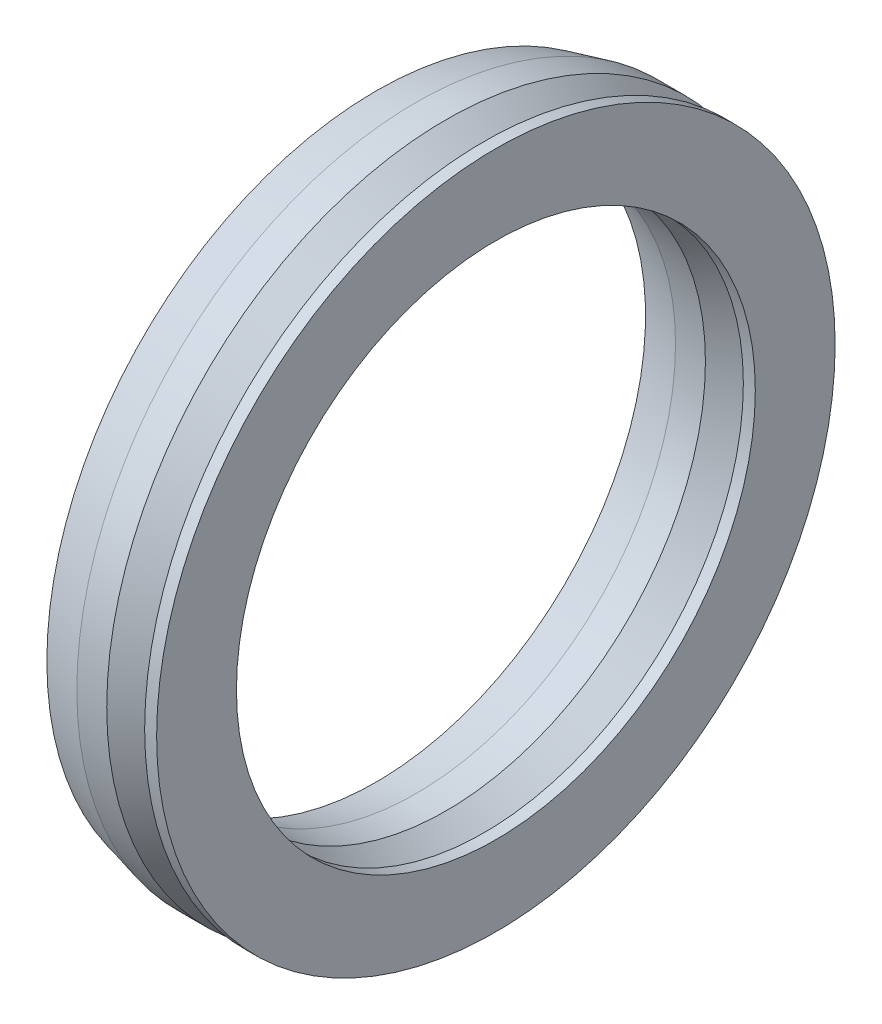
ISO-10303-21;
HEADER;
FILE_DESCRIPTION(('STEP AP214'),'2;1');
FILE_NAME('part.step','',(''),(''),'','','');
FILE_SCHEMA(('AUTOMOTIVE_DESIGN { 1 0 10303 214 1 1 1 1 }'));
ENDSEC;
DATA;
#1=APPLICATION_CONTEXT('core data for automotive mechanical design processes');
#2=APPLICATION_PROTOCOL_DEFINITION('international standard','automotive_design',2000,#1);
#3=PRODUCT_CONTEXT('',#1,'mechanical');
#4=PRODUCT('Part','Part','',(#3));
#5=PRODUCT_RELATED_PRODUCT_CATEGORY('part','',(#4));
#6=PRODUCT_DEFINITION_FORMATION('','',#4);
#7=PRODUCT_DEFINITION_CONTEXT('part definition',#1,'design');
#8=PRODUCT_DEFINITION('design','',#6,#7);
#9=PRODUCT_DEFINITION_SHAPE('','',#8);
#10=(LENGTH_UNIT() NAMED_UNIT(*) SI_UNIT(.MILLI.,.METRE.));
#11=(NAMED_UNIT(*) PLANE_ANGLE_UNIT() SI_UNIT($,.RADIAN.));
#12=(NAMED_UNIT(*) SI_UNIT($,.STERADIAN.) SOLID_ANGLE_UNIT());
#13=UNCERTAINTY_MEASURE_WITH_UNIT(LENGTH_MEASURE(1.E-05),#10,'distance_accuracy_value','');
#14=(GEOMETRIC_REPRESENTATION_CONTEXT(3) GLOBAL_UNCERTAINTY_ASSIGNED_CONTEXT((#13)) GLOBAL_UNIT_ASSIGNED_CONTEXT((#10,
#11,#12)) REPRESENTATION_CONTEXT('',''));
#15=CARTESIAN_POINT('',(0.,0.,0.));
#16=DIRECTION('',(0.,0.,1.));
#17=DIRECTION('',(1.,0.,0.));
#18=AXIS2_PLACEMENT_3D('',#15,#16,#17);
#19=CARTESIAN_POINT('',(-63.8265802983972,0.,0.));
#20=DIRECTION('',(-1.,0.,0.));
#21=DIRECTION('',(0.,0.,1.));
#22=AXIS2_PLACEMENT_3D('',#19,#20,#21);
#23=CYLINDRICAL_SURFACE('',#22,34.);
#24=CARTESIAN_POINT('',(-8.,0.,0.));
#25=DIRECTION('',(-1.,0.,0.));
#26=DIRECTION('',(0.,0.,1.));
#27=AXIS2_PLACEMENT_3D('',#24,#25,#26);
#28=CIRCLE('',#27,34.);
#29=CARTESIAN_POINT('',(-8.,0.,34.));
#30=VERTEX_POINT('',#29);
#31=EDGE_CURVE('E10',#30,#30,#28,.T.);
#32=ORIENTED_EDGE('',*,*,#31,.F.);
#33=EDGE_LOOP('',(#32));
#34=FACE_BOUND('',#33,.T.);
#35=CARTESIAN_POINT('',(-5.,0.,0.));
#36=DIRECTION('',(-1.,0.,0.));
#37=DIRECTION('',(0.,0.,1.));
#38=AXIS2_PLACEMENT_3D('',#35,#36,#37);
#39=CIRCLE('',#38,34.);
#40=CARTESIAN_POINT('',(-5.,0.,34.));
#41=VERTEX_POINT('',#40);
#42=EDGE_CURVE('E100',#41,#41,#39,.T.);
#43=ORIENTED_EDGE('',*,*,#42,.T.);
#44=EDGE_LOOP('',(#43));
#45=FACE_BOUND('',#44,.T.);
#46=ADVANCED_FACE('F33',(#34,#45),#23,.T.);
#47=CARTESIAN_POINT('',(-8.,0.,0.));
#48=DIRECTION('',(1.,0.,0.));
#49=DIRECTION('',(0.,0.,-1.));
#50=AXIS2_PLACEMENT_3D('',#47,#48,#49);
#51=CONICAL_SURFACE('',#50,34.,0.244978663126865);
#52=CARTESIAN_POINT('',(-12.,0.,0.));
#53=DIRECTION('',(-1.,0.,0.));
#54=DIRECTION('',(0.,0.,1.));
#55=AXIS2_PLACEMENT_3D('',#52,#53,#54);
#56=CIRCLE('',#55,33.);
#57=CARTESIAN_POINT('',(-12.,0.,33.));
#58=VERTEX_POINT('',#57);
#59=EDGE_CURVE('E39',#58,#58,#56,.T.);
#60=ORIENTED_EDGE('',*,*,#59,.F.);
#61=EDGE_LOOP('',(#60));
#62=FACE_BOUND('',#61,.T.);
#63=ORIENTED_EDGE('',*,*,#31,.T.);
#64=EDGE_LOOP('',(#63));
#65=FACE_BOUND('',#64,.T.);
#66=ADVANCED_FACE('F215',(#62,#65),#51,.T.);
#67=CARTESIAN_POINT('',(-12.,33.,0.));
#68=DIRECTION('',(1.,0.,0.));
#69=DIRECTION('',(0.,0.,-1.));
#70=AXIS2_PLACEMENT_3D('',#67,#68,#69);
#71=PLANE('',#70);
#72=CARTESIAN_POINT('',(-12.,0.,0.));
#73=DIRECTION('',(-1.,0.,0.));
#74=DIRECTION('',(0.,0.,1.));
#75=AXIS2_PLACEMENT_3D('',#72,#73,#74);
#76=CIRCLE('',#75,32.);
#77=CARTESIAN_POINT('',(-12.,0.,32.));
#78=VERTEX_POINT('',#77);
#79=EDGE_CURVE('E43',#78,#78,#76,.T.);
#80=ORIENTED_EDGE('',*,*,#79,.F.);
#81=EDGE_LOOP('',(#80));
#82=FACE_BOUND('',#81,.T.);
#83=ORIENTED_EDGE('',*,*,#59,.T.);
#84=EDGE_LOOP('',(#83));
#85=FACE_BOUND('',#84,.T.);
#86=ADVANCED_FACE('F210',(#82,#85),#71,.F.);
#87=CARTESIAN_POINT('',(-12.,0.,0.));
#88=DIRECTION('',(1.,0.,0.));
#89=DIRECTION('',(0.,0.,-1.));
#90=AXIS2_PLACEMENT_3D('',#87,#88,#89);
#91=CONICAL_SURFACE('',#90,32.,0.244978663126865);
#92=CARTESIAN_POINT('',(-8.,0.,0.));
#93=DIRECTION('',(-1.,0.,0.));
#94=DIRECTION('',(0.,0.,1.));
#95=AXIS2_PLACEMENT_3D('',#92,#93,#94);
#96=CIRCLE('',#95,33.);
#97=CARTESIAN_POINT('',(-8.,0.,33.));
#98=VERTEX_POINT('',#97);
#99=EDGE_CURVE('E47',#98,#98,#96,.T.);
#100=ORIENTED_EDGE('',*,*,#99,.F.);
#101=EDGE_LOOP('',(#100));
#102=FACE_BOUND('',#101,.T.);
#103=ORIENTED_EDGE('',*,*,#79,.T.);
#104=EDGE_LOOP('',(#103));
#105=FACE_BOUND('',#104,.T.);
#106=ADVANCED_FACE('F204',(#102,#105),#91,.F.);
#107=CARTESIAN_POINT('',(-8.,0.,0.));
#108=DIRECTION('',(-1.,0.,0.));
#109=DIRECTION('',(0.,0.,1.));
#110=AXIS2_PLACEMENT_3D('',#107,#108,#109);
#111=CONICAL_SURFACE('',#110,33.,0.540419500270585);
#112=CARTESIAN_POINT('',(-3.,0.,0.));
#113=DIRECTION('',(-1.,0.,0.));
#114=DIRECTION('',(0.,0.,1.));
#115=AXIS2_PLACEMENT_3D('',#112,#113,#114);
#116=CIRCLE('',#115,30.);
#117=CARTESIAN_POINT('',(-3.,0.,30.));
#118=VERTEX_POINT('',#117);
#119=EDGE_CURVE('E52',#118,#118,#116,.T.);
#120=ORIENTED_EDGE('',*,*,#119,.F.);
#121=EDGE_LOOP('',(#120));
#122=FACE_BOUND('',#121,.T.);
#123=ORIENTED_EDGE('',*,*,#99,.T.);
#124=EDGE_LOOP('',(#123));
#125=FACE_BOUND('',#124,.T.);
#126=ADVANCED_FACE('F198',(#122,#125),#111,.F.);
#127=CARTESIAN_POINT('',(-3.,0.,0.));
#128=DIRECTION('',(1.,0.,0.));
#129=DIRECTION('',(0.,0.,-1.));
#130=AXIS2_PLACEMENT_3D('',#127,#128,#129);
#131=CONICAL_SURFACE('',#130,30.,0.540419500270585);
#132=CARTESIAN_POINT('',(-8.,0.,0.));
#133=DIRECTION('',(-1.,0.,0.));
#134=DIRECTION('',(0.,0.,1.));
#135=AXIS2_PLACEMENT_3D('',#132,#133,#134);
#136=CIRCLE('',#135,27.);
#137=CARTESIAN_POINT('',(-8.,0.,27.));
#138=VERTEX_POINT('',#137);
#139=EDGE_CURVE('E55',#138,#138,#136,.T.);
#140=ORIENTED_EDGE('',*,*,#139,.F.);
#141=EDGE_LOOP('',(#140));
#142=FACE_BOUND('',#141,.T.);
#143=ORIENTED_EDGE('',*,*,#119,.T.);
#144=EDGE_LOOP('',(#143));
#145=FACE_BOUND('',#144,.T.);
#146=ADVANCED_FACE('F192',(#142,#145),#131,.T.);
#147=CARTESIAN_POINT('',(-8.,0.,0.));
#148=DIRECTION('',(-1.,0.,0.));
#149=DIRECTION('',(0.,0.,1.));
#150=AXIS2_PLACEMENT_3D('',#147,#148,#149);
#151=CONICAL_SURFACE('',#150,27.,0.244978663126865);
#152=CARTESIAN_POINT('',(-12.,0.,0.));
#153=DIRECTION('',(-1.,0.,0.));
#154=DIRECTION('',(0.,0.,1.));
#155=AXIS2_PLACEMENT_3D('',#152,#153,#154);
#156=CIRCLE('',#155,28.);
#157=CARTESIAN_POINT('',(-12.,0.,28.));
#158=VERTEX_POINT('',#157);
#159=EDGE_CURVE('E58',#158,#158,#156,.T.);
#160=ORIENTED_EDGE('',*,*,#159,.F.);
#161=EDGE_LOOP('',(#160));
#162=FACE_BOUND('',#161,.T.);
#163=ORIENTED_EDGE('',*,*,#139,.T.);
#164=EDGE_LOOP('',(#163));
#165=FACE_BOUND('',#164,.T.);
#166=ADVANCED_FACE('F186',(#162,#165),#151,.T.);
#167=CARTESIAN_POINT('',(-12.,27.,0.));
#168=DIRECTION('',(1.,0.,0.));
#169=DIRECTION('',(0.,0.,-1.));
#170=AXIS2_PLACEMENT_3D('',#167,#168,#169);
#171=PLANE('',#170);
#172=CARTESIAN_POINT('',(-12.,0.,0.));
#173=DIRECTION('',(-1.,0.,0.));
#174=DIRECTION('',(0.,0.,1.));
#175=AXIS2_PLACEMENT_3D('',#172,#173,#174);
#176=CIRCLE('',#175,27.);
#177=CARTESIAN_POINT('',(-12.,0.,27.));
#178=VERTEX_POINT('',#177);
#179=EDGE_CURVE('E61',#178,#178,#176,.T.);
#180=ORIENTED_EDGE('',*,*,#179,.F.);
#181=EDGE_LOOP('',(#180));
#182=FACE_BOUND('',#181,.T.);
#183=ORIENTED_EDGE('',*,*,#159,.T.);
#184=EDGE_LOOP('',(#183));
#185=FACE_BOUND('',#184,.T.);
#186=ADVANCED_FACE('F180',(#182,#185),#171,.F.);
#187=CARTESIAN_POINT('',(-12.,0.,0.));
#188=DIRECTION('',(-1.,0.,0.));
#189=DIRECTION('',(0.,0.,1.));
#190=AXIS2_PLACEMENT_3D('',#187,#188,#189);
#191=CONICAL_SURFACE('',#190,27.,0.244978663126865);
#192=CARTESIAN_POINT('',(-8.,0.,0.));
#193=DIRECTION('',(-1.,0.,0.));
#194=DIRECTION('',(0.,0.,1.));
#195=AXIS2_PLACEMENT_3D('',#192,#193,#194);
#196=CIRCLE('',#195,26.);
#197=CARTESIAN_POINT('',(-8.,0.,26.));
#198=VERTEX_POINT('',#197);
#199=EDGE_CURVE('E64',#198,#198,#196,.T.);
#200=ORIENTED_EDGE('',*,*,#199,.F.);
#201=EDGE_LOOP('',(#200));
#202=FACE_BOUND('',#201,.T.);
#203=ORIENTED_EDGE('',*,*,#179,.T.);
#204=EDGE_LOOP('',(#203));
#205=FACE_BOUND('',#204,.T.);
#206=ADVANCED_FACE('F174',(#202,#205),#191,.F.);
#207=CARTESIAN_POINT('',(-63.8265802983972,0.,0.));
#208=DIRECTION('',(-1.,0.,0.));
#209=DIRECTION('',(0.,0.,1.));
#210=AXIS2_PLACEMENT_3D('',#207,#208,#209);
#211=CYLINDRICAL_SURFACE('',#210,26.);
#212=CARTESIAN_POINT('',(-5.,0.,0.));
#213=DIRECTION('',(-1.,0.,0.));
#214=DIRECTION('',(0.,0.,1.));
#215=AXIS2_PLACEMENT_3D('',#212,#213,#214);
#216=CIRCLE('',#215,26.);
#217=CARTESIAN_POINT('',(-5.,0.,26.));
#218=VERTEX_POINT('',#217);
#219=EDGE_CURVE('E67',#218,#218,#216,.T.);
#220=ORIENTED_EDGE('',*,*,#219,.F.);
#221=EDGE_LOOP('',(#220));
#222=FACE_BOUND('',#221,.T.);
#223=ORIENTED_EDGE('',*,*,#199,.T.);
#224=EDGE_LOOP('',(#223));
#225=FACE_BOUND('',#224,.T.);
#226=ADVANCED_FACE('F168',(#222,#225),#211,.F.);
#227=CARTESIAN_POINT('',(-5.,0.,0.));
#228=DIRECTION('',(1.,0.,0.));
#229=DIRECTION('',(0.,0.,-1.));
#230=AXIS2_PLACEMENT_3D('',#227,#228,#229);
#231=CONICAL_SURFACE('',#230,26.,0.620249485982822);
#232=CARTESIAN_POINT('',(-2.2,0.,0.));
#233=DIRECTION('',(-1.,0.,0.));
#234=DIRECTION('',(0.,0.,1.));
#235=AXIS2_PLACEMENT_3D('',#232,#233,#234);
#236=CIRCLE('',#235,28.);
#237=CARTESIAN_POINT('',(-2.2,0.,28.));
#238=VERTEX_POINT('',#237);
#239=EDGE_CURVE('E70',#238,#238,#236,.T.);
#240=ORIENTED_EDGE('',*,*,#239,.F.);
#241=EDGE_LOOP('',(#240));
#242=FACE_BOUND('',#241,.T.);
#243=ORIENTED_EDGE('',*,*,#219,.T.);
#244=EDGE_LOOP('',(#243));
#245=FACE_BOUND('',#244,.T.);
#246=ADVANCED_FACE('F162',(#242,#245),#231,.F.);
#247=CARTESIAN_POINT('',(-2.2,28.5,0.));
#248=DIRECTION('',(-1.,0.,0.));
#249=DIRECTION('',(0.,0.,1.));
#250=AXIS2_PLACEMENT_3D('',#247,#248,#249);
#251=PLANE('',#250);
#252=CARTESIAN_POINT('',(-2.2,0.,0.));
#253=DIRECTION('',(-1.,0.,0.));
#254=DIRECTION('',(0.,0.,1.));
#255=AXIS2_PLACEMENT_3D('',#252,#253,#254);
#256=CIRCLE('',#255,28.5);
#257=CARTESIAN_POINT('',(-2.2,0.,28.5));
#258=VERTEX_POINT('',#257);
#259=EDGE_CURVE('E73',#258,#258,#256,.T.);
#260=ORIENTED_EDGE('',*,*,#259,.F.);
#261=EDGE_LOOP('',(#260));
#262=FACE_BOUND('',#261,.T.);
#263=ORIENTED_EDGE('',*,*,#239,.T.);
#264=EDGE_LOOP('',(#263));
#265=FACE_BOUND('',#264,.T.);
#266=ADVANCED_FACE('F156',(#262,#265),#251,.F.);
#267=CARTESIAN_POINT('',(-63.8265802983972,0.,0.));
#268=DIRECTION('',(-1.,0.,0.));
#269=DIRECTION('',(0.,0.,1.));
#270=AXIS2_PLACEMENT_3D('',#267,#268,#269);
#271=CYLINDRICAL_SURFACE('',#270,28.5);
#272=CARTESIAN_POINT('',(-1.19999999999999,0.,0.));
#273=DIRECTION('',(-1.,0.,0.));
#274=DIRECTION('',(0.,0.,1.));
#275=AXIS2_PLACEMENT_3D('',#272,#273,#274);
#276=CIRCLE('',#275,28.5);
#277=CARTESIAN_POINT('',(-1.19999999999999,0.,28.5));
#278=VERTEX_POINT('',#277);
#279=EDGE_CURVE('E76',#278,#278,#276,.T.);
#280=ORIENTED_EDGE('',*,*,#279,.F.);
#281=EDGE_LOOP('',(#280));
#282=FACE_BOUND('',#281,.T.);
#283=ORIENTED_EDGE('',*,*,#259,.T.);
#284=EDGE_LOOP('',(#283));
#285=FACE_BOUND('',#284,.T.);
#286=ADVANCED_FACE('F150',(#282,#285),#271,.F.);
#287=CARTESIAN_POINT('',(-1.2,26.,0.));
#288=DIRECTION('',(1.,0.,0.));
#289=DIRECTION('',(0.,0.,-1.));
#290=AXIS2_PLACEMENT_3D('',#287,#288,#289);
#291=PLANE('',#290);
#292=CARTESIAN_POINT('',(-1.19999999999999,0.,0.));
#293=DIRECTION('',(-1.,0.,0.));
#294=DIRECTION('',(0.,0.,1.));
#295=AXIS2_PLACEMENT_3D('',#292,#293,#294);
#296=CIRCLE('',#295,26.);
#297=CARTESIAN_POINT('',(-1.19999999999999,0.,26.));
#298=VERTEX_POINT('',#297);
#299=EDGE_CURVE('E79',#298,#298,#296,.T.);
#300=ORIENTED_EDGE('',*,*,#299,.F.);
#301=EDGE_LOOP('',(#300));
#302=FACE_BOUND('',#301,.T.);
#303=ORIENTED_EDGE('',*,*,#279,.T.);
#304=EDGE_LOOP('',(#303));
#305=FACE_BOUND('',#304,.T.);
#306=ADVANCED_FACE('F144',(#302,#305),#291,.F.);
#307=CARTESIAN_POINT('',(-63.8265802983972,0.,0.));
#308=DIRECTION('',(-1.,0.,0.));
#309=DIRECTION('',(0.,0.,1.));
#310=AXIS2_PLACEMENT_3D('',#307,#308,#309);
#311=CYLINDRICAL_SURFACE('',#310,26.);
#312=CARTESIAN_POINT('',(0.,0.,0.));
#313=DIRECTION('',(-1.,0.,0.));
#314=DIRECTION('',(0.,0.,1.));
#315=AXIS2_PLACEMENT_3D('',#312,#313,#314);
#316=CIRCLE('',#315,26.);
#317=CARTESIAN_POINT('',(0.,0.,26.));
#318=VERTEX_POINT('',#317);
#319=EDGE_CURVE('E82',#318,#318,#316,.T.);
#320=ORIENTED_EDGE('',*,*,#319,.F.);
#321=EDGE_LOOP('',(#320));
#322=FACE_BOUND('',#321,.T.);
#323=ORIENTED_EDGE('',*,*,#299,.T.);
#324=EDGE_LOOP('',(#323));
#325=FACE_BOUND('',#324,.T.);
#326=ADVANCED_FACE('F138',(#322,#325),#311,.F.);
#327=CARTESIAN_POINT('',(0.,34.,0.));
#328=DIRECTION('',(-1.,0.,0.));
#329=DIRECTION('',(0.,0.,1.));
#330=AXIS2_PLACEMENT_3D('',#327,#328,#329);
#331=PLANE('',#330);
#332=CARTESIAN_POINT('',(0.,0.,0.));
#333=DIRECTION('',(-1.,0.,0.));
#334=DIRECTION('',(0.,0.,1.));
#335=AXIS2_PLACEMENT_3D('',#332,#333,#334);
#336=CIRCLE('',#335,34.);
#337=CARTESIAN_POINT('',(0.,0.,34.));
#338=VERTEX_POINT('',#337);
#339=EDGE_CURVE('E85',#338,#338,#336,.T.);
#340=ORIENTED_EDGE('',*,*,#339,.F.);
#341=EDGE_LOOP('',(#340));
#342=FACE_BOUND('',#341,.T.);
#343=ORIENTED_EDGE('',*,*,#319,.T.);
#344=EDGE_LOOP('',(#343));
#345=FACE_BOUND('',#344,.T.);
#346=ADVANCED_FACE('F132',(#342,#345),#331,.F.);
#347=CARTESIAN_POINT('',(-63.8265802983972,0.,0.));
#348=DIRECTION('',(-1.,0.,0.));
#349=DIRECTION('',(0.,0.,1.));
#350=AXIS2_PLACEMENT_3D('',#347,#348,#349);
#351=CYLINDRICAL_SURFACE('',#350,34.);
#352=CARTESIAN_POINT('',(-1.19999999999999,0.,0.));
#353=DIRECTION('',(-1.,0.,0.));
#354=DIRECTION('',(0.,0.,1.));
#355=AXIS2_PLACEMENT_3D('',#352,#353,#354);
#356=CIRCLE('',#355,34.);
#357=CARTESIAN_POINT('',(-1.19999999999999,0.,34.));
#358=VERTEX_POINT('',#357);
#359=EDGE_CURVE('E88',#358,#358,#356,.T.);
#360=ORIENTED_EDGE('',*,*,#359,.F.);
#361=EDGE_LOOP('',(#360));
#362=FACE_BOUND('',#361,.T.);
#363=ORIENTED_EDGE('',*,*,#339,.T.);
#364=EDGE_LOOP('',(#363));
#365=FACE_BOUND('',#364,.T.);
#366=ADVANCED_FACE('F126',(#362,#365),#351,.T.);
#367=CARTESIAN_POINT('',(-1.2,34.,0.));
#368=DIRECTION('',(1.,0.,0.));
#369=DIRECTION('',(0.,0.,-1.));
#370=AXIS2_PLACEMENT_3D('',#367,#368,#369);
#371=PLANE('',#370);
#372=CARTESIAN_POINT('',(-1.19999999999999,0.,0.));
#373=DIRECTION('',(-1.,0.,0.));
#374=DIRECTION('',(0.,0.,1.));
#375=AXIS2_PLACEMENT_3D('',#372,#373,#374);
#376=CIRCLE('',#375,31.5);
#377=CARTESIAN_POINT('',(-1.19999999999999,0.,31.5));
#378=VERTEX_POINT('',#377);
#379=EDGE_CURVE('E91',#378,#378,#376,.T.);
#380=ORIENTED_EDGE('',*,*,#379,.F.);
#381=EDGE_LOOP('',(#380));
#382=FACE_BOUND('',#381,.T.);
#383=ORIENTED_EDGE('',*,*,#359,.T.);
#384=EDGE_LOOP('',(#383));
#385=FACE_BOUND('',#384,.T.);
#386=ADVANCED_FACE('F120',(#382,#385),#371,.F.);
#387=CARTESIAN_POINT('',(-63.8265802983972,0.,0.));
#388=DIRECTION('',(-1.,0.,0.));
#389=DIRECTION('',(0.,0.,1.));
#390=AXIS2_PLACEMENT_3D('',#387,#388,#389);
#391=CYLINDRICAL_SURFACE('',#390,31.5);
#392=CARTESIAN_POINT('',(-2.2,0.,0.));
#393=DIRECTION('',(-1.,0.,0.));
#394=DIRECTION('',(0.,0.,1.));
#395=AXIS2_PLACEMENT_3D('',#392,#393,#394);
#396=CIRCLE('',#395,31.5);
#397=CARTESIAN_POINT('',(-2.2,0.,31.5));
#398=VERTEX_POINT('',#397);
#399=EDGE_CURVE('E94',#398,#398,#396,.T.);
#400=ORIENTED_EDGE('',*,*,#399,.F.);
#401=EDGE_LOOP('',(#400));
#402=FACE_BOUND('',#401,.T.);
#403=ORIENTED_EDGE('',*,*,#379,.T.);
#404=EDGE_LOOP('',(#403));
#405=FACE_BOUND('',#404,.T.);
#406=ADVANCED_FACE('F114',(#402,#405),#391,.T.);
#407=CARTESIAN_POINT('',(-2.2,31.5,0.));
#408=DIRECTION('',(-1.,0.,0.));
#409=DIRECTION('',(0.,0.,1.));
#410=AXIS2_PLACEMENT_3D('',#407,#408,#409);
#411=PLANE('',#410);
#412=CARTESIAN_POINT('',(-2.2,0.,0.));
#413=DIRECTION('',(-1.,0.,0.));
#414=DIRECTION('',(0.,0.,1.));
#415=AXIS2_PLACEMENT_3D('',#412,#413,#414);
#416=CIRCLE('',#415,32.);
#417=CARTESIAN_POINT('',(-2.2,0.,32.));
#418=VERTEX_POINT('',#417);
#419=EDGE_CURVE('E97',#418,#418,#416,.T.);
#420=ORIENTED_EDGE('',*,*,#419,.F.);
#421=EDGE_LOOP('',(#420));
#422=FACE_BOUND('',#421,.T.);
#423=ORIENTED_EDGE('',*,*,#399,.T.);
#424=EDGE_LOOP('',(#423));
#425=FACE_BOUND('',#424,.T.);
#426=ADVANCED_FACE('F108',(#422,#425),#411,.F.);
#427=CARTESIAN_POINT('',(-2.2,0.,0.));
#428=DIRECTION('',(-1.,0.,0.));
#429=DIRECTION('',(0.,0.,1.));
#430=AXIS2_PLACEMENT_3D('',#427,#428,#429);
#431=CONICAL_SURFACE('',#430,32.,0.620249485982822);
#432=ORIENTED_EDGE('',*,*,#42,.F.);
#433=EDGE_LOOP('',(#432));
#434=FACE_BOUND('',#433,.T.);
#435=ORIENTED_EDGE('',*,*,#419,.T.);
#436=EDGE_LOOP('',(#435));
#437=FACE_BOUND('',#436,.T.);
#438=ADVANCED_FACE('F105',(#434,#437),#431,.T.);
#439=CLOSED_SHELL('',(#46,#66,#86,#106,#126,#146,#166,#186,#206,#226,#246,#266,#286,#306,#326,
#346,#366,#386,#406,#426,#438));
#440=MANIFOLD_SOLID_BREP('B2',#439);
#441=ADVANCED_BREP_SHAPE_REPRESENTATION('',(#18,#440),#14);
#442=SHAPE_DEFINITION_REPRESENTATION(#9,#441);
ENDSEC;
END-ISO-10303-21;
